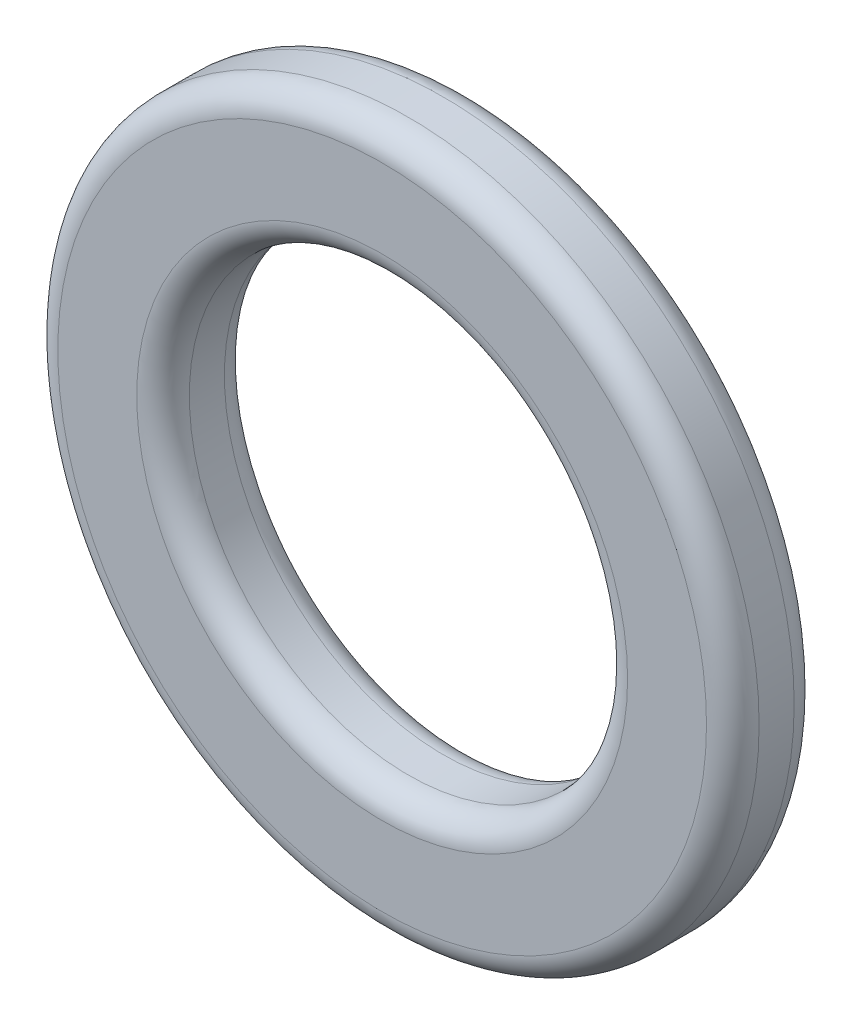
ISO-10303-21;
HEADER;
FILE_DESCRIPTION(('STEP AP214'),'2;1');
FILE_NAME('part.step','',(''),(''),'','','');
FILE_SCHEMA(('AUTOMOTIVE_DESIGN { 1 0 10303 214 1 1 1 1 }'));
ENDSEC;
DATA;
#1=APPLICATION_CONTEXT('core data for automotive mechanical design processes');
#2=APPLICATION_PROTOCOL_DEFINITION('international standard','automotive_design',2000,#1);
#3=PRODUCT_CONTEXT('',#1,'mechanical');
#4=PRODUCT('Part','Part','',(#3));
#5=PRODUCT_RELATED_PRODUCT_CATEGORY('part','',(#4));
#6=PRODUCT_DEFINITION_FORMATION('','',#4);
#7=PRODUCT_DEFINITION_CONTEXT('part definition',#1,'design');
#8=PRODUCT_DEFINITION('design','',#6,#7);
#9=PRODUCT_DEFINITION_SHAPE('','',#8);
#10=(LENGTH_UNIT() NAMED_UNIT(*) SI_UNIT(.MILLI.,.METRE.));
#11=(NAMED_UNIT(*) PLANE_ANGLE_UNIT() SI_UNIT($,.RADIAN.));
#12=(NAMED_UNIT(*) SI_UNIT($,.STERADIAN.) SOLID_ANGLE_UNIT());
#13=UNCERTAINTY_MEASURE_WITH_UNIT(LENGTH_MEASURE(1.E-05),#10,'distance_accuracy_value','');
#14=(GEOMETRIC_REPRESENTATION_CONTEXT(3) GLOBAL_UNCERTAINTY_ASSIGNED_CONTEXT((#13)) GLOBAL_UNIT_ASSIGNED_CONTEXT((#10,
#11,#12)) REPRESENTATION_CONTEXT('',''));
#15=CARTESIAN_POINT('',(0.,0.,0.));
#16=DIRECTION('',(0.,0.,1.));
#17=DIRECTION('',(1.,0.,0.));
#18=AXIS2_PLACEMENT_3D('',#15,#16,#17);
#19=CARTESIAN_POINT('',(0.,0.,1.));
#20=DIRECTION('',(0.,0.,1.));
#21=DIRECTION('',(1.,0.,0.));
#22=AXIS2_PLACEMENT_3D('',#19,#20,#21);
#23=PLANE('',#22);
#24=CARTESIAN_POINT('',(0.,0.,1.));
#25=DIRECTION('',(0.,0.,1.));
#26=DIRECTION('',(1.,0.,0.));
#27=AXIS2_PLACEMENT_3D('',#24,#25,#26);
#28=CIRCLE('',#27,2.8);
#29=CARTESIAN_POINT('',(2.8,0.,1.));
#30=VERTEX_POINT('',#29);
#31=EDGE_CURVE('E10',#30,#30,#28,.F.);
#32=ORIENTED_EDGE('',*,*,#31,.T.);
#33=EDGE_LOOP('',(#32));
#34=FACE_BOUND('',#33,.T.);
#35=CARTESIAN_POINT('',(0.,0.,1.));
#36=DIRECTION('',(0.,0.,1.));
#37=DIRECTION('',(1.,0.,0.));
#38=AXIS2_PLACEMENT_3D('',#35,#36,#37);
#39=CIRCLE('',#38,3.7);
#40=CARTESIAN_POINT('',(3.7,0.,1.));
#41=VERTEX_POINT('',#40);
#42=EDGE_CURVE('E45',#41,#41,#39,.T.);
#43=ORIENTED_EDGE('',*,*,#42,.T.);
#44=EDGE_LOOP('',(#43));
#45=FACE_BOUND('',#44,.T.);
#46=ADVANCED_FACE('F37',(#34,#45),#23,.T.);
#47=CARTESIAN_POINT('',(0.,0.,0.));
#48=DIRECTION('',(0.,0.,1.));
#49=DIRECTION('',(1.,0.,0.));
#50=AXIS2_PLACEMENT_3D('',#47,#48,#49);
#51=PLANE('',#50);
#52=CARTESIAN_POINT('',(0.,0.,0.));
#53=DIRECTION('',(0.,0.,1.));
#54=DIRECTION('',(1.,0.,0.));
#55=AXIS2_PLACEMENT_3D('',#52,#53,#54);
#56=CIRCLE('',#55,2.8);
#57=CARTESIAN_POINT('',(2.8,0.,0.));
#58=VERTEX_POINT('',#57);
#59=EDGE_CURVE('E69',#58,#58,#56,.T.);
#60=ORIENTED_EDGE('',*,*,#59,.T.);
#61=EDGE_LOOP('',(#60));
#62=FACE_BOUND('',#61,.T.);
#63=CARTESIAN_POINT('',(0.,0.,0.));
#64=DIRECTION('',(0.,0.,1.));
#65=DIRECTION('',(1.,0.,0.));
#66=AXIS2_PLACEMENT_3D('',#63,#64,#65);
#67=CIRCLE('',#66,3.7);
#68=CARTESIAN_POINT('',(3.7,0.,0.));
#69=VERTEX_POINT('',#68);
#70=EDGE_CURVE('E73',#69,#69,#67,.F.);
#71=ORIENTED_EDGE('',*,*,#70,.T.);
#72=EDGE_LOOP('',(#71));
#73=FACE_BOUND('',#72,.T.);
#74=ADVANCED_FACE('F78',(#62,#73),#51,.F.);
#75=CARTESIAN_POINT('',(0.,0.,1.));
#76=DIRECTION('',(0.,0.,-1.));
#77=DIRECTION('',(-1.,0.,0.));
#78=AXIS2_PLACEMENT_3D('',#75,#76,#77);
#79=CYLINDRICAL_SURFACE('',#78,4.);
#80=CARTESIAN_POINT('',(0.,0.,0.3));
#81=DIRECTION('',(0.,0.,1.));
#82=DIRECTION('',(1.,0.,0.));
#83=AXIS2_PLACEMENT_3D('',#80,#81,#82);
#84=CIRCLE('',#83,4.);
#85=CARTESIAN_POINT('',(4.,0.,0.3));
#86=VERTEX_POINT('',#85);
#87=EDGE_CURVE('E50',#86,#86,#84,.T.);
#88=ORIENTED_EDGE('',*,*,#87,.T.);
#89=EDGE_LOOP('',(#88));
#90=FACE_BOUND('',#89,.T.);
#91=CARTESIAN_POINT('',(0.,0.,0.7));
#92=DIRECTION('',(0.,0.,1.));
#93=DIRECTION('',(1.,0.,0.));
#94=AXIS2_PLACEMENT_3D('',#91,#92,#93);
#95=CIRCLE('',#94,4.);
#96=CARTESIAN_POINT('',(4.,0.,0.7));
#97=VERTEX_POINT('',#96);
#98=EDGE_CURVE('E55',#97,#97,#95,.F.);
#99=ORIENTED_EDGE('',*,*,#98,.T.);
#100=EDGE_LOOP('',(#99));
#101=FACE_BOUND('',#100,.T.);
#102=ADVANCED_FACE('F88',(#90,#101),#79,.T.);
#103=CARTESIAN_POINT('',(0.,0.,1.));
#104=DIRECTION('',(0.,0.,-1.));
#105=DIRECTION('',(-1.,0.,0.));
#106=AXIS2_PLACEMENT_3D('',#103,#104,#105);
#107=CYLINDRICAL_SURFACE('',#106,2.5);
#108=CARTESIAN_POINT('',(0.,0.,0.3));
#109=DIRECTION('',(0.,0.,1.));
#110=DIRECTION('',(1.,0.,0.));
#111=AXIS2_PLACEMENT_3D('',#108,#109,#110);
#112=CIRCLE('',#111,2.5);
#113=CARTESIAN_POINT('',(2.5,0.,0.3));
#114=VERTEX_POINT('',#113);
#115=EDGE_CURVE('E61',#114,#114,#112,.F.);
#116=ORIENTED_EDGE('',*,*,#115,.T.);
#117=EDGE_LOOP('',(#116));
#118=FACE_BOUND('',#117,.T.);
#119=CARTESIAN_POINT('',(0.,0.,0.7));
#120=DIRECTION('',(0.,0.,1.));
#121=DIRECTION('',(1.,0.,0.));
#122=AXIS2_PLACEMENT_3D('',#119,#120,#121);
#123=CIRCLE('',#122,2.5);
#124=CARTESIAN_POINT('',(2.5,0.,0.7));
#125=VERTEX_POINT('',#124);
#126=EDGE_CURVE('E65',#125,#125,#123,.T.);
#127=ORIENTED_EDGE('',*,*,#126,.T.);
#128=EDGE_LOOP('',(#127));
#129=FACE_BOUND('',#128,.T.);
#130=ADVANCED_FACE('F91',(#118,#129),#107,.F.);
#131=CARTESIAN_POINT('',(0.,0.,0.3));
#132=DIRECTION('',(0.,0.,1.));
#133=DIRECTION('',(1.,0.,0.));
#134=AXIS2_PLACEMENT_3D('',#131,#132,#133);
#135=TOROIDAL_SURFACE('',#134,2.8,0.3);
#136=ORIENTED_EDGE('',*,*,#115,.F.);
#137=EDGE_LOOP('',(#136));
#138=FACE_BOUND('',#137,.T.);
#139=ORIENTED_EDGE('',*,*,#59,.F.);
#140=EDGE_LOOP('',(#139));
#141=FACE_BOUND('',#140,.T.);
#142=ADVANCED_FACE('F84',(#138,#141),#135,.T.);
#143=CARTESIAN_POINT('',(0.,0.,0.3));
#144=DIRECTION('',(0.,0.,1.));
#145=DIRECTION('',(1.,0.,0.));
#146=AXIS2_PLACEMENT_3D('',#143,#144,#145);
#147=TOROIDAL_SURFACE('',#146,3.7,0.3);
#148=ORIENTED_EDGE('',*,*,#70,.F.);
#149=EDGE_LOOP('',(#148));
#150=FACE_BOUND('',#149,.T.);
#151=ORIENTED_EDGE('',*,*,#87,.F.);
#152=EDGE_LOOP('',(#151));
#153=FACE_BOUND('',#152,.T.);
#154=ADVANCED_FACE('F80',(#150,#153),#147,.T.);
#155=CARTESIAN_POINT('',(0.,0.,0.7));
#156=DIRECTION('',(0.,0.,1.));
#157=DIRECTION('',(1.,0.,0.));
#158=AXIS2_PLACEMENT_3D('',#155,#156,#157);
#159=TOROIDAL_SURFACE('',#158,2.8,0.3);
#160=ORIENTED_EDGE('',*,*,#31,.F.);
#161=EDGE_LOOP('',(#160));
#162=FACE_BOUND('',#161,.T.);
#163=ORIENTED_EDGE('',*,*,#126,.F.);
#164=EDGE_LOOP('',(#163));
#165=FACE_BOUND('',#164,.T.);
#166=ADVANCED_FACE('F83',(#162,#165),#159,.T.);
#167=CARTESIAN_POINT('',(0.,0.,0.7));
#168=DIRECTION('',(0.,0.,1.));
#169=DIRECTION('',(1.,0.,0.));
#170=AXIS2_PLACEMENT_3D('',#167,#168,#169);
#171=TOROIDAL_SURFACE('',#170,3.7,0.3);
#172=ORIENTED_EDGE('',*,*,#98,.F.);
#173=EDGE_LOOP('',(#172));
#174=FACE_BOUND('',#173,.T.);
#175=ORIENTED_EDGE('',*,*,#42,.F.);
#176=EDGE_LOOP('',(#175));
#177=FACE_BOUND('',#176,.T.);
#178=ADVANCED_FACE('F39',(#174,#177),#171,.T.);
#179=CLOSED_SHELL('',(#46,#74,#102,#130,#142,#154,#166,#178));
#180=MANIFOLD_SOLID_BREP('B2',#179);
#181=ADVANCED_BREP_SHAPE_REPRESENTATION('',(#18,#180),#14);
#182=SHAPE_DEFINITION_REPRESENTATION(#9,#181);
ENDSEC;
END-ISO-10303-21;
